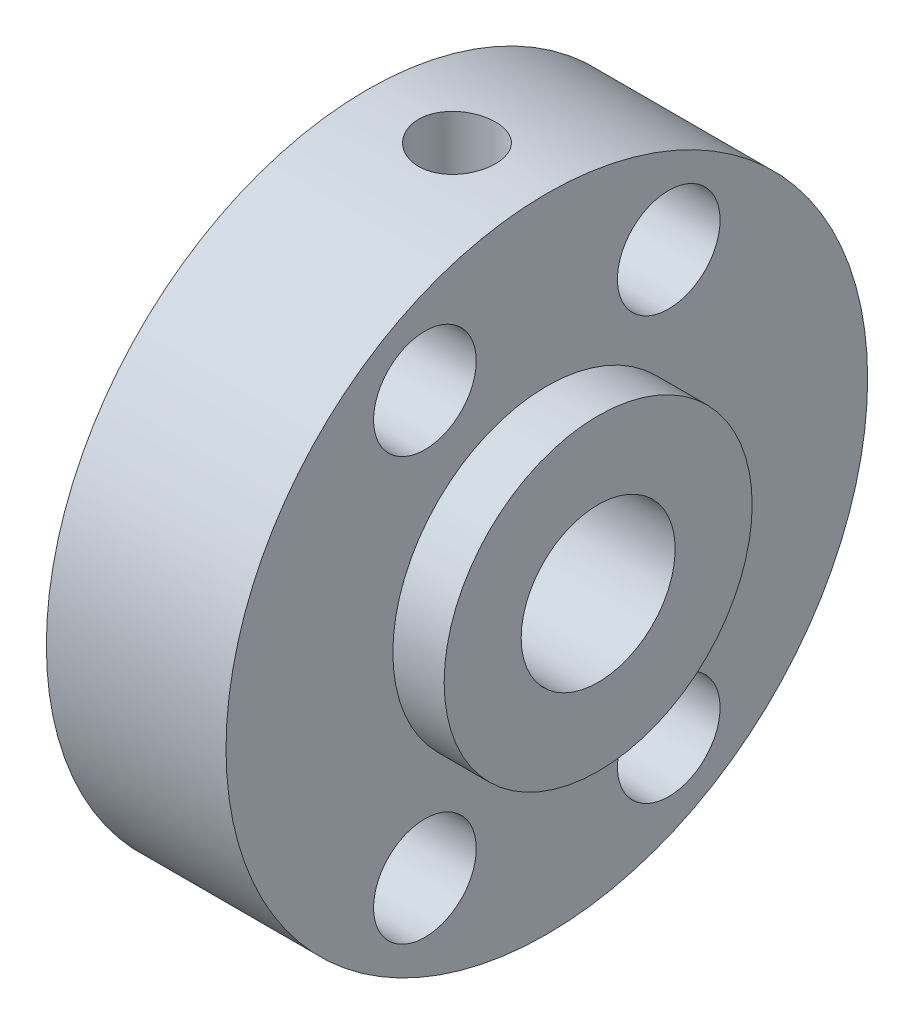
ISO-10303-21;
HEADER;
FILE_DESCRIPTION(('STEP AP214'),'2;1');
FILE_NAME('part.step','',(''),(''),'','','');
FILE_SCHEMA(('AUTOMOTIVE_DESIGN { 1 0 10303 214 1 1 1 1 }'));
ENDSEC;
DATA;
#1=APPLICATION_CONTEXT('core data for automotive mechanical design processes');
#2=APPLICATION_PROTOCOL_DEFINITION('international standard','automotive_design',2000,#1);
#3=PRODUCT_CONTEXT('',#1,'mechanical');
#4=PRODUCT('Part','Part','',(#3));
#5=PRODUCT_RELATED_PRODUCT_CATEGORY('part','',(#4));
#6=PRODUCT_DEFINITION_FORMATION('','',#4);
#7=PRODUCT_DEFINITION_CONTEXT('part definition',#1,'design');
#8=PRODUCT_DEFINITION('design','',#6,#7);
#9=PRODUCT_DEFINITION_SHAPE('','',#8);
#10=(LENGTH_UNIT() NAMED_UNIT(*) SI_UNIT(.MILLI.,.METRE.));
#11=(NAMED_UNIT(*) PLANE_ANGLE_UNIT() SI_UNIT($,.RADIAN.));
#12=(NAMED_UNIT(*) SI_UNIT($,.STERADIAN.) SOLID_ANGLE_UNIT());
#13=UNCERTAINTY_MEASURE_WITH_UNIT(LENGTH_MEASURE(1.E-05),#10,'distance_accuracy_value','');
#14=(GEOMETRIC_REPRESENTATION_CONTEXT(3) GLOBAL_UNCERTAINTY_ASSIGNED_CONTEXT((#13)) GLOBAL_UNIT_ASSIGNED_CONTEXT((#10,
#11,#12)) REPRESENTATION_CONTEXT('',''));
#15=CARTESIAN_POINT('',(0.,0.,0.));
#16=DIRECTION('',(0.,0.,1.));
#17=DIRECTION('',(1.,0.,0.));
#18=AXIS2_PLACEMENT_3D('',#15,#16,#17);
#19=CARTESIAN_POINT('',(0.,0.,0.));
#20=DIRECTION('',(-1.,0.,0.));
#21=DIRECTION('',(0.,0.,1.));
#22=AXIS2_PLACEMENT_3D('',#19,#20,#21);
#23=CYLINDRICAL_SURFACE('',#22,3.);
#24=CARTESIAN_POINT('',(9.,0.,0.));
#25=DIRECTION('',(-1.,0.,0.));
#26=DIRECTION('',(0.,0.,1.));
#27=AXIS2_PLACEMENT_3D('',#24,#25,#26);
#28=CIRCLE('',#27,3.);
#29=CARTESIAN_POINT('',(9.,0.,3.));
#30=VERTEX_POINT('',#29);
#31=EDGE_CURVE('E58',#30,#30,#28,.T.);
#32=ORIENTED_EDGE('',*,*,#31,.F.);
#33=EDGE_LOOP('',(#32));
#34=FACE_BOUND('',#33,.T.);
#35=CARTESIAN_POINT('',(0.,0.,0.));
#36=DIRECTION('',(-1.,0.,0.));
#37=DIRECTION('',(0.,0.,1.));
#38=AXIS2_PLACEMENT_3D('',#35,#36,#37);
#39=CIRCLE('',#38,3.);
#40=CARTESIAN_POINT('',(0.,0.,3.));
#41=VERTEX_POINT('',#40);
#42=EDGE_CURVE('E10',#41,#41,#39,.T.);
#43=ORIENTED_EDGE('',*,*,#42,.T.);
#44=EDGE_LOOP('',(#43));
#45=FACE_BOUND('',#44,.T.);
#46=CARTESIAN_POINT('',(3.5,2.59807621135332,-1.5));
#47=CARTESIAN_POINT('',(3.57816171229288,2.59808302092689,-1.4999945446118));
#48=CARTESIAN_POINT('',(3.65642211728757,2.60165701781635,-1.49384995609982));
#49=CARTESIAN_POINT('',(3.81054089701573,2.61543549678079,-1.46958481484708));
#50=CARTESIAN_POINT('',(3.88639387256511,2.62565391083339,-1.45143909683127));
#51=CARTESIAN_POINT('',(4.03317749651591,2.65124019908098,-1.40414992304972));
#52=CARTESIAN_POINT('',(4.10413197871038,2.66658065209878,-1.3750649287406));
#53=CARTESIAN_POINT('',(4.24013630299508,2.70063997225287,-1.30690128806456));
#54=CARTESIAN_POINT('',(4.30518582539369,2.71935902214097,-1.26782210105366));
#55=CARTESIAN_POINT('',(4.43345859283626,2.75995303586162,-1.17699981079632));
#56=CARTESIAN_POINT('',(4.49608870351032,2.7819609545693,-1.12447805421565));
#57=CARTESIAN_POINT('',(4.61211258261006,2.82557974178559,-1.0098807114217));
#58=CARTESIAN_POINT('',(4.66550174387528,2.84719040746875,-0.947800388673439));
#59=CARTESIAN_POINT('',(4.76505072672149,2.88932215429424,-0.810734345121818));
#60=CARTESIAN_POINT('',(4.81048065178929,2.90967159627259,-0.735160783518861));
#61=CARTESIAN_POINT('',(4.88771127986864,2.94526134149293,-0.576235539899255));
#62=CARTESIAN_POINT('',(4.91952058420575,2.96050486775612,-0.492888807207232));
#63=CARTESIAN_POINT('',(4.96625699195164,2.98320691866356,-0.327067415888966));
#64=CARTESIAN_POINT('',(4.9822242895333,2.99114220331338,-0.244952685733226));
#65=CARTESIAN_POINT('',(5.00024917801256,3.000113757691,-0.0788559430467724));
#66=CARTESIAN_POINT('',(5.00231518519356,3.00115420176885,0.00512490876560744));
#67=CARTESIAN_POINT('',(4.99287998904448,2.99644472874675,0.164748786635625));
#68=CARTESIAN_POINT('',(4.98254297671817,2.99127743838241,0.240481798765187));
#69=CARTESIAN_POINT('',(4.95067873414301,2.97561367889621,0.388970657877483));
#70=CARTESIAN_POINT('',(4.92915066653566,2.96511681099591,0.461726281640888));
#71=CARTESIAN_POINT('',(4.87537615086528,2.93957374931482,0.60346408735433));
#72=CARTESIAN_POINT('',(4.8429855302419,2.92446662293799,0.672380135272767));
#73=CARTESIAN_POINT('',(4.76860487569776,2.89106468980031,0.803965202269992));
#74=CARTESIAN_POINT('',(4.72661140504647,2.87276874236226,0.866631973257968));
#75=CARTESIAN_POINT('',(4.62965697270048,2.83266591598844,0.990260491347292));
#76=CARTESIAN_POINT('',(4.57384545751099,2.81069063997263,1.05050111254404));
#77=CARTESIAN_POINT('',(4.45311541260473,2.76681510880218,1.16115655544667));
#78=CARTESIAN_POINT('',(4.38818994158891,2.74491492398443,1.21156381736135));
#79=CARTESIAN_POINT('',(4.24602771136387,2.70216234138727,1.30425800196332));
#80=CARTESIAN_POINT('',(4.16827096541868,2.68146479986061,1.34582597246708));
#81=CARTESIAN_POINT('',(4.0055934929615,2.64563175417864,1.41497866950185));
#82=CARTESIAN_POINT('',(3.92068035047366,2.63049045069101,1.44257798731633));
#83=CARTESIAN_POINT('',(3.75317823307581,2.60916953725552,1.48077031653756));
#84=CARTESIAN_POINT('',(3.67093832143467,2.60237483772745,1.49253768317996));
#85=CARTESIAN_POINT('',(3.50539798772519,2.59676879042414,1.50227541991714));
#86=CARTESIAN_POINT('',(3.42209835632032,2.59795180333967,1.50025553597254));
#87=CARTESIAN_POINT('',(3.26651912213191,2.60751504810877,1.48355406501595));
#88=CARTESIAN_POINT('',(3.19403082333811,2.61509381259981,1.4702817250687));
#89=CARTESIAN_POINT('',(3.05244832059356,2.63541032327012,1.43354442694866));
#90=CARTESIAN_POINT('',(2.98335522388009,2.64814974007551,1.41007616793542));
#91=CARTESIAN_POINT('',(2.84688300364596,2.67804333119485,1.35247138290733));
#92=CARTESIAN_POINT('',(2.77973147471967,2.69537464864595,1.31789109553908));
#93=CARTESIAN_POINT('',(2.65179609269151,2.73234179245875,1.23943059602371));
#94=CARTESIAN_POINT('',(2.59101553473008,2.75197880032721,1.19554560649832));
#95=CARTESIAN_POINT('',(2.46953184871468,2.79431997684504,1.09325575079828));
#96=CARTESIAN_POINT('',(2.40980427392351,2.81709874731434,1.03371790847245));
#97=CARTESIAN_POINT('',(2.30088164300961,2.86101352466839,0.905106743097433));
#98=CARTESIAN_POINT('',(2.25169014465419,2.88214897511564,0.83603021198302));
#99=CARTESIAN_POINT('',(2.16413941107485,2.92112042536435,0.687803043838135));
#100=CARTESIAN_POINT('',(2.12610032268364,2.93885462508044,0.608434646361169));
#101=CARTESIAN_POINT('',(2.06429314421391,2.96825032438951,0.443283546961623));
#102=CARTESIAN_POINT('',(2.04051252295054,2.97991715514559,0.357506552088264));
#103=CARTESIAN_POINT('',(2.00994715373801,2.99501262272824,0.190469523495626));
#104=CARTESIAN_POINT('',(2.00180318618583,2.99909891862287,0.109517165775686));
#105=CARTESIAN_POINT('',(1.9987351018184,3.00063195562697,-0.0526889789268051));
#106=CARTESIAN_POINT('',(2.00380635721466,2.99808102100335,-0.13394265044263));
#107=CARTESIAN_POINT('',(2.02612461019344,2.98700953256884,-0.28880698847572));
#108=CARTESIAN_POINT('',(2.04254727388651,2.97889342001985,-0.362568476716895));
#109=CARTESIAN_POINT('',(2.08599049895446,2.95788140495135,-0.506168928275426));
#110=CARTESIAN_POINT('',(2.11301258014018,2.94498481699194,-0.576007327433263));
#111=CARTESIAN_POINT('',(2.17809057824896,2.9148889612218,-0.713135109367326));
#112=CARTESIAN_POINT('',(2.21656898481176,2.89752925798199,-0.780187714050069));
#113=CARTESIAN_POINT('',(2.30293689628858,2.86032199712739,-0.907161962721036));
#114=CARTESIAN_POINT('',(2.35083072367351,2.84047329837541,-0.96708031112236));
#115=CARTESIAN_POINT('',(2.46019570853405,2.79792915339941,-1.08437100623534));
#116=CARTESIAN_POINT('',(2.52254373121579,2.77514698517547,-1.14089652680891));
#117=CARTESIAN_POINT('',(2.65617608169466,2.73094614244278,-1.24299493109201));
#118=CARTESIAN_POINT('',(2.72746823130153,2.70952868642798,-1.28855812501509));
#119=CARTESIAN_POINT('',(2.87995496987143,2.66999407957374,-1.36864661967848));
#120=CARTESIAN_POINT('',(2.9613912966931,2.65200261384405,-1.40277759894141));
#121=CARTESIAN_POINT('',(3.12999860650967,2.62299234492527,-1.45631806425962));
#122=CARTESIAN_POINT('',(3.21714933336903,2.61195024221553,-1.47577678676302));
#123=CARTESIAN_POINT('',(3.33770803347799,2.60293908902686,-1.49155051179662));
#124=CARTESIAN_POINT('',(3.37005184159682,2.60112193507728,-1.49471415744578));
#125=CARTESIAN_POINT('',(3.43492472102337,2.59868903831625,-1.49894010763494));
#126=CARTESIAN_POINT('',(3.46745380457881,2.59807337587664,-1.50000227159981));
#127=CARTESIAN_POINT('',(3.5,2.59807621135332,-1.5));
#128=B_SPLINE_CURVE_WITH_KNOTS('',3,(#46,#47,#48,#49,#50,#51,#52,#53,#54,#55,#56,#57,#58,#59,
#60,#61,#62,#63,#64,#65,#66,#67,#68,#69,#70,#71,#72,#73,#74,#75,#76,#77,#78,#79,#80,#81,#82,#83,
#84,#85,#86,#87,#88,#89,#90,#91,#92,#93,#94,#95,#96,#97,#98,#99,#100,#101,#102,#103,#104,#105,
#106,#107,#108,#109,#110,#111,#112,#113,#114,#115,#116,#117,#118,#119,#120,#121,#122,#123,#124,
#125,#126,#127),.UNSPECIFIED.,.T.,.F.,(4,2,2,2,2,2,2,2,2,2,2,2,2,2,2,2,2,2,2,2,2,2,2,2,2,2,2,2,
2,2,2,2,2,2,2,2,2,2,2,2,4),(0.,0.234348183892073,0.469189339237207,0.702792893878327,
0.936409088167724,1.18929346874735,1.44230356626556,1.71236838358145,1.98226240445836,
2.23295227451903,2.4834903552906,2.71224146226807,2.94100968776182,3.1729430209672,
3.40495949025407,3.65890787185336,3.91305072368878,4.18333262594172,4.45333161317557,
4.70193436281317,4.95036139782559,5.17161275136038,5.39293578654094,5.62450944609131,
5.85620229330071,6.11710115370919,6.37808797467303,6.64596272119448,6.91360169713157,
7.1566840558423,7.39968130190957,7.62666637307238,7.85368400268019,8.09041126079207,
8.32724745151078,8.587653627751,8.84828914267731,9.11716123557907,9.38512699504139,
9.48270202777963,9.5802835874181),.UNSPECIFIED.);
#129=CARTESIAN_POINT('',(3.5,2.59807621135332,-1.5));
#130=VERTEX_POINT('',#129);
#131=EDGE_CURVE('E83',#130,#130,#128,.T.);
#132=ORIENTED_EDGE('',*,*,#131,.F.);
#133=EDGE_LOOP('',(#132));
#134=FACE_BOUND('',#133,.T.);
#135=ADVANCED_FACE('F30',(#34,#45,#134),#23,.F.);
#136=CARTESIAN_POINT('',(0.,0.,0.));
#137=DIRECTION('',(-1.,0.,0.));
#138=DIRECTION('',(0.,0.,1.));
#139=AXIS2_PLACEMENT_3D('',#136,#137,#138);
#140=CYLINDRICAL_SURFACE('',#139,12.5);
#141=CARTESIAN_POINT('',(0.,0.,0.));
#142=DIRECTION('',(-1.,0.,0.));
#143=DIRECTION('',(0.,0.,1.));
#144=AXIS2_PLACEMENT_3D('',#141,#142,#143);
#145=CIRCLE('',#144,12.5);
#146=CARTESIAN_POINT('',(0.,0.,12.5));
#147=VERTEX_POINT('',#146);
#148=EDGE_CURVE('E43',#147,#147,#145,.T.);
#149=ORIENTED_EDGE('',*,*,#148,.F.);
#150=EDGE_LOOP('',(#149));
#151=FACE_BOUND('',#150,.T.);
#152=CARTESIAN_POINT('',(7.,0.,0.));
#153=DIRECTION('',(-1.,0.,0.));
#154=DIRECTION('',(0.,0.,1.));
#155=AXIS2_PLACEMENT_3D('',#152,#153,#154);
#156=CIRCLE('',#155,12.5);
#157=CARTESIAN_POINT('',(7.,0.,12.5));
#158=VERTEX_POINT('',#157);
#159=EDGE_CURVE('E47',#158,#158,#156,.T.);
#160=ORIENTED_EDGE('',*,*,#159,.T.);
#161=EDGE_LOOP('',(#160));
#162=FACE_BOUND('',#161,.T.);
#163=CARTESIAN_POINT('',(3.5,12.4096736459909,-1.5));
#164=CARTESIAN_POINT('',(3.41607042940482,12.4096748089167,-1.49999641586388));
#165=CARTESIAN_POINT('',(3.3320877399393,12.4105342894214,-1.49293206748169));
#166=CARTESIAN_POINT('',(3.16645769398422,12.4138782255216,-1.46486159354819));
#167=CARTESIAN_POINT('',(3.08481290215949,12.4163643992983,-1.44384072619508));
#168=CARTESIAN_POINT('',(2.92628079724309,12.4226761552619,-1.38848417307918));
#169=CARTESIAN_POINT('',(2.84939036943189,12.426500849368,-1.35415731394874));
#170=CARTESIAN_POINT('',(2.70247642894952,12.4350576249844,-1.27318168778971));
#171=CARTESIAN_POINT('',(2.63245170421602,12.4397895458966,-1.22653510106007));
#172=CARTESIAN_POINT('',(2.50088011419491,12.4496550027324,-1.12198571965019));
#173=CARTESIAN_POINT('',(2.4393738528257,12.4547902908254,-1.06403198625323));
#174=CARTESIAN_POINT('',(2.32693564091905,12.4648680792729,-0.938622932174393));
#175=CARTESIAN_POINT('',(2.2760042070291,12.4698105701984,-0.871167147527067));
#176=CARTESIAN_POINT('',(2.18601673353186,12.4789637011531,-0.728414784233987));
#177=CARTESIAN_POINT('',(2.14699729213018,12.4831720690333,-0.653094976924494));
#178=CARTESIAN_POINT('',(2.08217576980763,12.4903635621621,-0.496912883636388));
#179=CARTESIAN_POINT('',(2.05637323512614,12.4933467294733,-0.41605078804277));
#180=CARTESIAN_POINT('',(2.01883887194828,12.4977393662263,-0.25149392849254));
#181=CARTESIAN_POINT('',(2.00703967327712,12.4991563682204,-0.167814735521689));
#182=CARTESIAN_POINT('',(1.99763820034474,12.5002827183051,0.000347248334282976));
#183=CARTESIAN_POINT('',(2.00003540892089,12.4999921286017,0.0848300098341701));
#184=CARTESIAN_POINT('',(2.01890456092568,12.4977421462633,0.251742833758765));
#185=CARTESIAN_POINT('',(2.0353040524862,12.4957913442169,0.334181218784106));
#186=CARTESIAN_POINT('',(2.081599075858,12.490449821119,0.495127185045588));
#187=CARTESIAN_POINT('',(2.11149484709083,12.4870590745233,0.573634696521302));
#188=CARTESIAN_POINT('',(2.18401136445326,12.4792038952277,0.724715561629688));
#189=CARTESIAN_POINT('',(2.22666361800321,12.4747368094346,0.797273648637692));
#190=CARTESIAN_POINT('',(2.32345944947808,12.465229048358,0.934229460099392));
#191=CARTESIAN_POINT('',(2.37760351320781,12.4601883488298,0.998626839383445));
#192=CARTESIAN_POINT('',(2.49625217477023,12.4500603372648,1.11785860561525));
#193=CARTESIAN_POINT('',(2.56081989068675,12.4449729316271,1.17263019439189));
#194=CARTESIAN_POINT('',(2.69826575683975,12.4353563023037,1.27056795912578));
#195=CARTESIAN_POINT('',(2.77114392958224,12.4308270801297,1.31373410365263));
#196=CARTESIAN_POINT('',(2.92319624507369,12.4228396027608,1.38723839179325));
#197=CARTESIAN_POINT('',(3.00237272062895,12.4193817467283,1.41757175578821));
#198=CARTESIAN_POINT('',(3.16474617975059,12.4139364153306,1.46449505016189));
#199=CARTESIAN_POINT('',(3.24794298505965,12.4119488748366,1.48108558929275));
#200=CARTESIAN_POINT('',(3.41544154818834,12.4096810007818,1.49996964356083));
#201=CARTESIAN_POINT('',(3.49973321794057,12.4093901280317,1.50235142135386));
#202=CARTESIAN_POINT('',(3.66751439042147,12.4105206650573,1.49298299027801));
#203=CARTESIAN_POINT('',(3.75100390884369,12.411942041265,1.48123305845624));
#204=CARTESIAN_POINT('',(3.91454789179899,12.4163273137489,1.44400895971009));
#205=CARTESIAN_POINT('',(3.99461217340466,12.4192864301079,1.41857731249469));
#206=CARTESIAN_POINT('',(4.14933964148798,12.4264098926624,1.35475538396312));
#207=CARTESIAN_POINT('',(4.22400265225152,12.4305742780457,1.31636468129306));
#208=CARTESIAN_POINT('',(4.36620814748731,12.4396643656649,1.22749651360805));
#209=CARTESIAN_POINT('',(4.43371414344065,12.4445936804928,1.17696103570738));
#210=CARTESIAN_POINT('',(4.5593175565059,12.4546467770184,1.06532008918353));
#211=CARTESIAN_POINT('',(4.61741463670294,12.4597705656719,1.0042142422181));
#212=CARTESIAN_POINT('',(4.72285987361746,12.4696675472455,0.87278213633386));
#213=CARTESIAN_POINT('',(4.77015012325571,12.4744387628015,0.802409249708916));
#214=CARTESIAN_POINT('',(4.85223910466455,12.483063621558,0.654668214705289));
#215=CARTESIAN_POINT('',(4.88703807118722,12.4869172820019,0.577300197822207));
#216=CARTESIAN_POINT('',(4.9430605024379,12.4932640215257,0.417959622359992));
#217=CARTESIAN_POINT('',(4.96431775994212,12.4957604851314,0.33599908532359));
#218=CARTESIAN_POINT('',(4.99276337179108,12.4991255682254,0.169640292495738));
#219=CARTESIAN_POINT('',(4.99995230834657,12.4999942550783,0.0852421377306299));
#220=CARTESIAN_POINT('',(5.00004692205616,12.5000056524324,-0.0830300031278303));
#221=CARTESIAN_POINT('',(4.99304201834161,12.4991591682624,-0.166903952329437));
#222=CARTESIAN_POINT('',(4.96513677254876,12.4958567701035,-0.332273612398118));
#223=CARTESIAN_POINT('',(4.94423643502524,12.4934008566421,-0.413769324044744));
#224=CARTESIAN_POINT('',(4.88916099243421,12.4871544009745,-0.572059777991808));
#225=CARTESIAN_POINT('',(4.85498981777275,12.4833642539575,-0.648855904373999));
#226=CARTESIAN_POINT('',(4.7743519652078,12.474869622158,-0.795637705262655));
#227=CARTESIAN_POINT('',(4.72788518779857,12.4701651299761,-0.865623324646851));
#228=CARTESIAN_POINT('',(4.62364315899687,12.4603319681132,-0.997254742124291));
#229=CARTESIAN_POINT('',(4.56580132233712,12.4552009088046,-1.0588476339384));
#230=CARTESIAN_POINT('',(4.44058848142378,12.4451123432295,-1.17148865356204));
#231=CARTESIAN_POINT('',(4.37321521774934,12.4401548784622,-1.22253427406543));
#232=CARTESIAN_POINT('',(4.23057853191475,12.4309559603764,-1.31278537364373));
#233=CARTESIAN_POINT('',(4.15528783586352,12.4267171228205,-1.35194799100155));
#234=CARTESIAN_POINT('',(3.99919112312461,12.419466118837,-1.41701902911872));
#235=CARTESIAN_POINT('',(3.91839126440112,12.4164526081981,-1.44294198213015));
#236=CARTESIAN_POINT('',(3.7809702304473,12.4127313618494,-1.4745350503682));
#237=CARTESIAN_POINT('',(3.72521862402006,12.4115903654975,-1.48407082470974));
#238=CARTESIAN_POINT('',(3.61298603393287,12.4100611186528,-1.49680448454755));
#239=CARTESIAN_POINT('',(3.5565050552187,12.4096728630583,-1.50000241299709));
#240=CARTESIAN_POINT('',(3.5,12.4096736459909,-1.5));
#241=B_SPLINE_CURVE_WITH_KNOTS('',3,(#163,#164,#165,#166,#167,#168,#169,#170,#171,#172,#173,
#174,#175,#176,#177,#178,#179,#180,#181,#182,#183,#184,#185,#186,#187,#188,#189,#190,#191,#192,
#193,#194,#195,#196,#197,#198,#199,#200,#201,#202,#203,#204,#205,#206,#207,#208,#209,#210,#211,
#212,#213,#214,#215,#216,#217,#218,#219,#220,#221,#222,#223,#224,#225,#226,#227,#228,#229,#230,
#231,#232,#233,#234,#235,#236,#237,#238,#239,#240),.UNSPECIFIED.,.T.,.F.,(4,2,2,2,2,2,2,2,2,2,2,
2,2,2,2,2,2,2,2,2,2,2,2,2,2,2,2,2,2,2,2,2,2,2,2,2,2,2,4),(0.,0.25158230660961,0.503430774819312,
0.755112462522262,1.0067496383611,1.25954776660377,1.51235824273611,1.76593780876769,
2.01950866836447,2.27185458608052,2.52419131111312,2.77523023079344,3.02627360403335,
3.27794222677635,3.52962149067918,3.78288622204422,4.03615163930559,4.28951130338294,
4.54285974404081,4.79463277043148,5.0464008609825,5.29739099483104,5.54838929022027,
5.80061125155308,6.05284224246467,6.30639464647639,6.55994228515918,6.81285470170487,
7.06575665136928,7.31707030939075,7.56838388503437,7.81962308616497,8.07086432058376,
8.32362252061905,8.57644073759112,8.83016031080822,9.08360079205962,9.25297814464871,
9.42235434931908),.UNSPECIFIED.);
#242=CARTESIAN_POINT('',(3.5,12.4096736459909,-1.5));
#243=VERTEX_POINT('',#242);
#244=EDGE_CURVE('E34',#243,#243,#241,.T.);
#245=ORIENTED_EDGE('',*,*,#244,.F.);
#246=EDGE_LOOP('',(#245));
#247=FACE_BOUND('',#246,.T.);
#248=ADVANCED_FACE('F124',(#151,#162,#247),#140,.T.);
#249=CARTESIAN_POINT('',(0.,3.,0.));
#250=DIRECTION('',(1.,0.,0.));
#251=DIRECTION('',(0.,0.,-1.));
#252=AXIS2_PLACEMENT_3D('',#249,#250,#251);
#253=PLANE('',#252);
#254=CARTESIAN_POINT('',(0.,8.22724133595217,-4.75000000000001));
#255=DIRECTION('',(1.,0.,0.));
#256=DIRECTION('',(0.,0.,-1.));
#257=AXIS2_PLACEMENT_3D('',#254,#255,#256);
#258=CIRCLE('',#257,2.);
#259=CARTESIAN_POINT('',(0.,8.22724133595217,-6.75000000000001));
#260=VERTEX_POINT('',#259);
#261=EDGE_CURVE('E65',#260,#260,#258,.T.);
#262=ORIENTED_EDGE('',*,*,#261,.T.);
#263=EDGE_LOOP('',(#262));
#264=FACE_BOUND('',#263,.T.);
#265=CARTESIAN_POINT('',(0.,-8.22724133595218,4.75000000000002));
#266=DIRECTION('',(1.,0.,0.));
#267=DIRECTION('',(0.,0.,-1.));
#268=AXIS2_PLACEMENT_3D('',#265,#266,#267);
#269=CIRCLE('',#268,2.);
#270=CARTESIAN_POINT('',(0.,-8.22724133595218,2.75000000000002));
#271=VERTEX_POINT('',#270);
#272=EDGE_CURVE('E71',#271,#271,#269,.T.);
#273=ORIENTED_EDGE('',*,*,#272,.T.);
#274=EDGE_LOOP('',(#273));
#275=FACE_BOUND('',#274,.T.);
#276=CARTESIAN_POINT('',(0.,-8.22724133595216,-4.75000000000002));
#277=DIRECTION('',(1.,0.,0.));
#278=DIRECTION('',(0.,0.,-1.));
#279=AXIS2_PLACEMENT_3D('',#276,#277,#278);
#280=CIRCLE('',#279,2.);
#281=CARTESIAN_POINT('',(0.,-8.22724133595216,-6.75000000000002));
#282=VERTEX_POINT('',#281);
#283=EDGE_CURVE('E72',#282,#282,#280,.T.);
#284=ORIENTED_EDGE('',*,*,#283,.T.);
#285=EDGE_LOOP('',(#284));
#286=FACE_BOUND('',#285,.T.);
#287=CARTESIAN_POINT('',(0.,8.22724133595216,4.75000000000001));
#288=DIRECTION('',(1.,0.,0.));
#289=DIRECTION('',(0.,0.,-1.));
#290=AXIS2_PLACEMENT_3D('',#287,#288,#289);
#291=CIRCLE('',#290,2.);
#292=CARTESIAN_POINT('',(0.,8.22724133595216,2.75000000000001));
#293=VERTEX_POINT('',#292);
#294=EDGE_CURVE('E61',#293,#293,#291,.T.);
#295=ORIENTED_EDGE('',*,*,#294,.T.);
#296=EDGE_LOOP('',(#295));
#297=FACE_BOUND('',#296,.T.);
#298=ORIENTED_EDGE('',*,*,#42,.F.);
#299=EDGE_LOOP('',(#298));
#300=FACE_BOUND('',#299,.T.);
#301=ORIENTED_EDGE('',*,*,#148,.T.);
#302=EDGE_LOOP('',(#301));
#303=FACE_BOUND('',#302,.T.);
#304=ADVANCED_FACE('F122',(#264,#275,#286,#297,#300,#303),#253,.F.);
#305=CARTESIAN_POINT('',(7.,12.5,0.));
#306=DIRECTION('',(-1.,0.,0.));
#307=DIRECTION('',(0.,0.,1.));
#308=AXIS2_PLACEMENT_3D('',#305,#306,#307);
#309=PLANE('',#308);
#310=CARTESIAN_POINT('',(7.,8.22724133595217,-4.75000000000001));
#311=DIRECTION('',(1.,0.,0.));
#312=DIRECTION('',(0.,0.,-1.));
#313=AXIS2_PLACEMENT_3D('',#310,#311,#312);
#314=CIRCLE('',#313,2.);
#315=CARTESIAN_POINT('',(7.,8.22724133595217,-6.75000000000001));
#316=VERTEX_POINT('',#315);
#317=EDGE_CURVE('E75',#316,#316,#314,.T.);
#318=ORIENTED_EDGE('',*,*,#317,.F.);
#319=EDGE_LOOP('',(#318));
#320=FACE_BOUND('',#319,.T.);
#321=CARTESIAN_POINT('',(7.,-8.22724133595218,4.75000000000002));
#322=DIRECTION('',(1.,0.,0.));
#323=DIRECTION('',(0.,0.,-1.));
#324=AXIS2_PLACEMENT_3D('',#321,#322,#323);
#325=CIRCLE('',#324,2.);
#326=CARTESIAN_POINT('',(7.,-8.22724133595218,2.75000000000002));
#327=VERTEX_POINT('',#326);
#328=EDGE_CURVE('E68',#327,#327,#325,.T.);
#329=ORIENTED_EDGE('',*,*,#328,.F.);
#330=EDGE_LOOP('',(#329));
#331=FACE_BOUND('',#330,.T.);
#332=CARTESIAN_POINT('',(7.,-8.22724133595216,-4.75000000000002));
#333=DIRECTION('',(1.,0.,0.));
#334=DIRECTION('',(0.,0.,-1.));
#335=AXIS2_PLACEMENT_3D('',#332,#333,#334);
#336=CIRCLE('',#335,2.);
#337=CARTESIAN_POINT('',(7.,-8.22724133595216,-6.75000000000002));
#338=VERTEX_POINT('',#337);
#339=EDGE_CURVE('E80',#338,#338,#336,.T.);
#340=ORIENTED_EDGE('',*,*,#339,.F.);
#341=EDGE_LOOP('',(#340));
#342=FACE_BOUND('',#341,.T.);
#343=CARTESIAN_POINT('',(7.,8.22724133595216,4.75000000000001));
#344=DIRECTION('',(1.,0.,0.));
#345=DIRECTION('',(0.,0.,-1.));
#346=AXIS2_PLACEMENT_3D('',#343,#344,#345);
#347=CIRCLE('',#346,2.);
#348=CARTESIAN_POINT('',(7.,8.22724133595216,2.75000000000001));
#349=VERTEX_POINT('',#348);
#350=EDGE_CURVE('E62',#349,#349,#347,.T.);
#351=ORIENTED_EDGE('',*,*,#350,.F.);
#352=EDGE_LOOP('',(#351));
#353=FACE_BOUND('',#352,.T.);
#354=ORIENTED_EDGE('',*,*,#159,.F.);
#355=EDGE_LOOP('',(#354));
#356=FACE_BOUND('',#355,.T.);
#357=CARTESIAN_POINT('',(7.,0.,0.));
#358=DIRECTION('',(-1.,0.,0.));
#359=DIRECTION('',(0.,0.,1.));
#360=AXIS2_PLACEMENT_3D('',#357,#358,#359);
#361=CIRCLE('',#360,6.);
#362=CARTESIAN_POINT('',(7.,0.,6.));
#363=VERTEX_POINT('',#362);
#364=EDGE_CURVE('E52',#363,#363,#361,.T.);
#365=ORIENTED_EDGE('',*,*,#364,.T.);
#366=EDGE_LOOP('',(#365));
#367=FACE_BOUND('',#366,.T.);
#368=ADVANCED_FACE('F119',(#320,#331,#342,#353,#356,#367),#309,.F.);
#369=CARTESIAN_POINT('',(0.,0.,0.));
#370=DIRECTION('',(-1.,0.,0.));
#371=DIRECTION('',(0.,0.,1.));
#372=AXIS2_PLACEMENT_3D('',#369,#370,#371);
#373=CYLINDRICAL_SURFACE('',#372,6.);
#374=ORIENTED_EDGE('',*,*,#364,.F.);
#375=EDGE_LOOP('',(#374));
#376=FACE_BOUND('',#375,.T.);
#377=CARTESIAN_POINT('',(9.,0.,0.));
#378=DIRECTION('',(-1.,0.,0.));
#379=DIRECTION('',(0.,0.,1.));
#380=AXIS2_PLACEMENT_3D('',#377,#378,#379);
#381=CIRCLE('',#380,6.);
#382=CARTESIAN_POINT('',(9.,0.,6.));
#383=VERTEX_POINT('',#382);
#384=EDGE_CURVE('E55',#383,#383,#381,.T.);
#385=ORIENTED_EDGE('',*,*,#384,.T.);
#386=EDGE_LOOP('',(#385));
#387=FACE_BOUND('',#386,.T.);
#388=ADVANCED_FACE('F115',(#376,#387),#373,.T.);
#389=CARTESIAN_POINT('',(9.,6.,0.));
#390=DIRECTION('',(-1.,0.,0.));
#391=DIRECTION('',(0.,0.,1.));
#392=AXIS2_PLACEMENT_3D('',#389,#390,#391);
#393=PLANE('',#392);
#394=ORIENTED_EDGE('',*,*,#384,.F.);
#395=EDGE_LOOP('',(#394));
#396=FACE_BOUND('',#395,.T.);
#397=ORIENTED_EDGE('',*,*,#31,.T.);
#398=EDGE_LOOP('',(#397));
#399=FACE_BOUND('',#398,.T.);
#400=ADVANCED_FACE('F111',(#396,#399),#393,.F.);
#401=CARTESIAN_POINT('',(0.,8.22724133595216,4.75000000000001));
#402=DIRECTION('',(1.,0.,0.));
#403=DIRECTION('',(0.,0.,-1.));
#404=AXIS2_PLACEMENT_3D('',#401,#402,#403);
#405=CYLINDRICAL_SURFACE('',#404,2.);
#406=ORIENTED_EDGE('',*,*,#294,.F.);
#407=EDGE_LOOP('',(#406));
#408=FACE_BOUND('',#407,.T.);
#409=ORIENTED_EDGE('',*,*,#350,.T.);
#410=EDGE_LOOP('',(#409));
#411=FACE_BOUND('',#410,.T.);
#412=ADVANCED_FACE('F101',(#408,#411),#405,.F.);
#413=CARTESIAN_POINT('',(0.,-8.22724133595216,-4.75000000000002));
#414=DIRECTION('',(1.,0.,0.));
#415=DIRECTION('',(0.,0.,-1.));
#416=AXIS2_PLACEMENT_3D('',#413,#414,#415);
#417=CYLINDRICAL_SURFACE('',#416,2.);
#418=ORIENTED_EDGE('',*,*,#283,.F.);
#419=EDGE_LOOP('',(#418));
#420=FACE_BOUND('',#419,.T.);
#421=ORIENTED_EDGE('',*,*,#339,.T.);
#422=EDGE_LOOP('',(#421));
#423=FACE_BOUND('',#422,.T.);
#424=ADVANCED_FACE('F96',(#420,#423),#417,.F.);
#425=CARTESIAN_POINT('',(0.,-8.22724133595218,4.75000000000002));
#426=DIRECTION('',(1.,0.,0.));
#427=DIRECTION('',(0.,0.,-1.));
#428=AXIS2_PLACEMENT_3D('',#425,#426,#427);
#429=CYLINDRICAL_SURFACE('',#428,2.);
#430=ORIENTED_EDGE('',*,*,#272,.F.);
#431=EDGE_LOOP('',(#430));
#432=FACE_BOUND('',#431,.T.);
#433=ORIENTED_EDGE('',*,*,#328,.T.);
#434=EDGE_LOOP('',(#433));
#435=FACE_BOUND('',#434,.T.);
#436=ADVANCED_FACE('F100',(#432,#435),#429,.F.);
#437=CARTESIAN_POINT('',(0.,8.22724133595217,-4.75000000000001));
#438=DIRECTION('',(1.,0.,0.));
#439=DIRECTION('',(0.,0.,-1.));
#440=AXIS2_PLACEMENT_3D('',#437,#438,#439);
#441=CYLINDRICAL_SURFACE('',#440,2.);
#442=ORIENTED_EDGE('',*,*,#261,.F.);
#443=EDGE_LOOP('',(#442));
#444=FACE_BOUND('',#443,.T.);
#445=ORIENTED_EDGE('',*,*,#317,.T.);
#446=EDGE_LOOP('',(#445));
#447=FACE_BOUND('',#446,.T.);
#448=ADVANCED_FACE('F94',(#444,#447),#441,.F.);
#449=CARTESIAN_POINT('',(3.5,30.,0.));
#450=DIRECTION('',(0.,-1.,0.));
#451=DIRECTION('',(0.,0.,-1.));
#452=AXIS2_PLACEMENT_3D('',#449,#450,#451);
#453=CYLINDRICAL_SURFACE('',#452,1.5);
#454=ORIENTED_EDGE('',*,*,#244,.T.);
#455=EDGE_LOOP('',(#454));
#456=FACE_BOUND('',#455,.T.);
#457=ORIENTED_EDGE('',*,*,#131,.T.);
#458=EDGE_LOOP('',(#457));
#459=FACE_BOUND('',#458,.T.);
#460=ADVANCED_FACE('F90',(#456,#459),#453,.F.);
#461=CLOSED_SHELL('',(#135,#248,#304,#368,#388,#400,#412,#424,#436,#448,#460));
#462=MANIFOLD_SOLID_BREP('B2',#461);
#463=ADVANCED_BREP_SHAPE_REPRESENTATION('',(#18,#462),#14);
#464=SHAPE_DEFINITION_REPRESENTATION(#9,#463);
ENDSEC;
END-ISO-10303-21;
